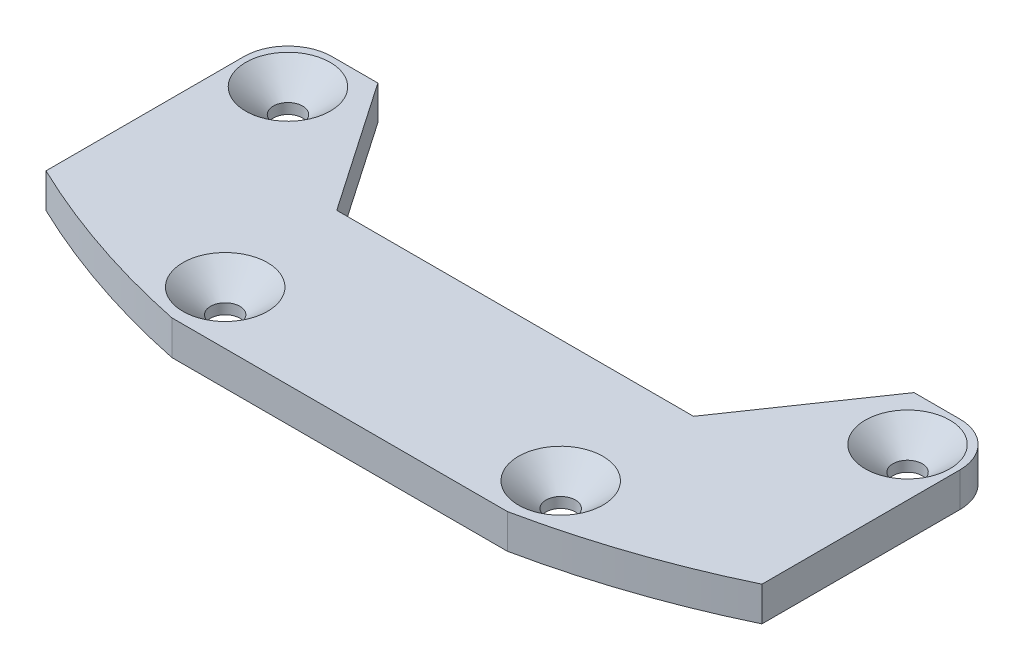
ISO-10303-21;
HEADER;
FILE_DESCRIPTION(('STEP AP214'),'2;1');
FILE_NAME('part.step','',(''),(''),'','','');
FILE_SCHEMA(('AUTOMOTIVE_DESIGN { 1 0 10303 214 1 1 1 1 }'));
ENDSEC;
DATA;
#1=APPLICATION_CONTEXT('core data for automotive mechanical design processes');
#2=APPLICATION_PROTOCOL_DEFINITION('international standard','automotive_design',2000,#1);
#3=PRODUCT_CONTEXT('',#1,'mechanical');
#4=PRODUCT('Part','Part','',(#3));
#5=PRODUCT_RELATED_PRODUCT_CATEGORY('part','',(#4));
#6=PRODUCT_DEFINITION_FORMATION('','',#4);
#7=PRODUCT_DEFINITION_CONTEXT('part definition',#1,'design');
#8=PRODUCT_DEFINITION('design','',#6,#7);
#9=PRODUCT_DEFINITION_SHAPE('','',#8);
#10=(LENGTH_UNIT() NAMED_UNIT(*) SI_UNIT(.MILLI.,.METRE.));
#11=(NAMED_UNIT(*) PLANE_ANGLE_UNIT() SI_UNIT($,.RADIAN.));
#12=(NAMED_UNIT(*) SI_UNIT($,.STERADIAN.) SOLID_ANGLE_UNIT());
#13=UNCERTAINTY_MEASURE_WITH_UNIT(LENGTH_MEASURE(1.E-05),#10,'distance_accuracy_value','');
#14=(GEOMETRIC_REPRESENTATION_CONTEXT(3) GLOBAL_UNCERTAINTY_ASSIGNED_CONTEXT((#13)) GLOBAL_UNIT_ASSIGNED_CONTEXT((#10,
#11,#12)) REPRESENTATION_CONTEXT('',''));
#15=CARTESIAN_POINT('',(0.,0.,0.));
#16=DIRECTION('',(0.,0.,1.));
#17=DIRECTION('',(1.,0.,0.));
#18=AXIS2_PLACEMENT_3D('',#15,#16,#17);
#19=CARTESIAN_POINT('',(28.956,3.175,-10.06475));
#20=DIRECTION('',(0.,-1.,0.));
#21=DIRECTION('',(0.,0.,-1.));
#22=AXIS2_PLACEMENT_3D('',#19,#20,#21);
#23=PLANE('',#22);
#24=CARTESIAN_POINT('',(-28.575,3.175,-9.68374999999997));
#25=DIRECTION('',(0.,-1.,0.));
#26=DIRECTION('',(0.,0.,-1.));
#27=AXIS2_PLACEMENT_3D('',#24,#25,#26);
#28=CIRCLE('',#27,3.8989);
#29=CARTESIAN_POINT('',(-28.575,3.175,-13.58265));
#30=VERTEX_POINT('',#29);
#31=EDGE_CURVE('E216',#30,#30,#28,.T.);
#32=ORIENTED_EDGE('',*,*,#31,.T.);
#33=EDGE_LOOP('',(#32));
#34=FACE_BOUND('',#33,.T.);
#35=CARTESIAN_POINT('',(-15.4730360223843,3.175,9.2075));
#36=DIRECTION('',(0.,-1.,0.));
#37=DIRECTION('',(0.,0.,-1.));
#38=AXIS2_PLACEMENT_3D('',#35,#36,#37);
#39=CIRCLE('',#38,3.8989);
#40=CARTESIAN_POINT('',(-15.4730360223843,3.175,5.3086));
#41=VERTEX_POINT('',#40);
#42=EDGE_CURVE('E213',#41,#41,#39,.T.);
#43=ORIENTED_EDGE('',*,*,#42,.T.);
#44=EDGE_LOOP('',(#43));
#45=FACE_BOUND('',#44,.T.);
#46=CARTESIAN_POINT('',(15.4730360223843,3.175,9.2075));
#47=DIRECTION('',(0.,-1.,0.));
#48=DIRECTION('',(0.,0.,-1.));
#49=AXIS2_PLACEMENT_3D('',#46,#47,#48);
#50=CIRCLE('',#49,3.8989);
#51=CARTESIAN_POINT('',(15.4730360223843,3.175,5.3086));
#52=VERTEX_POINT('',#51);
#53=EDGE_CURVE('E210',#52,#52,#50,.T.);
#54=ORIENTED_EDGE('',*,*,#53,.T.);
#55=EDGE_LOOP('',(#54));
#56=FACE_BOUND('',#55,.T.);
#57=CARTESIAN_POINT('',(28.575,3.175,-9.68374999999997));
#58=DIRECTION('',(0.,-1.,0.));
#59=DIRECTION('',(0.,0.,-1.));
#60=AXIS2_PLACEMENT_3D('',#57,#58,#59);
#61=CIRCLE('',#60,3.8989);
#62=CARTESIAN_POINT('',(28.575,3.175,-13.58265));
#63=VERTEX_POINT('',#62);
#64=EDGE_CURVE('E207',#63,#63,#61,.T.);
#65=ORIENTED_EDGE('',*,*,#64,.T.);
#66=EDGE_LOOP('',(#65));
#67=FACE_BOUND('',#66,.T.);
#68=CARTESIAN_POINT('',(28.956,3.175,-10.06475));
#69=DIRECTION('',(0.,1.,0.));
#70=DIRECTION('',(0.,0.,-1.));
#71=AXIS2_PLACEMENT_3D('',#68,#69,#70);
#72=CIRCLE('',#71,4.064);
#73=CARTESIAN_POINT('',(33.02,3.175,-10.06475));
#74=VERTEX_POINT('',#73);
#75=CARTESIAN_POINT('',(28.956,3.175,-14.12875));
#76=VERTEX_POINT('',#75);
#77=EDGE_CURVE('E177',#74,#76,#72,.T.);
#78=ORIENTED_EDGE('',*,*,#77,.T.);
#79=DIRECTION('',(-1.,0.,0.));
#80=VECTOR('',#79,1.);
#81=CARTESIAN_POINT('',(24.7300560498807,3.175,-14.12875));
#82=LINE('',#81,#80);
#83=CARTESIAN_POINT('',(24.7300560498807,3.175,-14.12875));
#84=VERTEX_POINT('',#83);
#85=EDGE_CURVE('E106',#76,#84,#82,.T.);
#86=ORIENTED_EDGE('',*,*,#85,.T.);
#87=DIRECTION('',(-0.565651383382918,0.,0.824644476412103));
#88=VECTOR('',#87,1.);
#89=CARTESIAN_POINT('',(24.7300560498807,3.175,-14.12875));
#90=LINE('',#89,#88);
#91=CARTESIAN_POINT('',(16.4542667422174,3.175,-2.06375000000011));
#92=VERTEX_POINT('',#91);
#93=EDGE_CURVE('E326',#84,#92,#90,.T.);
#94=ORIENTED_EDGE('',*,*,#93,.T.);
#95=DIRECTION('',(-1.,0.,0.));
#96=VECTOR('',#95,1.);
#97=CARTESIAN_POINT('',(-16.4542667422174,3.175,-2.06375000000011));
#98=LINE('',#97,#96);
#99=CARTESIAN_POINT('',(-16.4542667422174,3.175,-2.06375000000011));
#100=VERTEX_POINT('',#99);
#101=EDGE_CURVE('E328',#92,#100,#98,.T.);
#102=ORIENTED_EDGE('',*,*,#101,.T.);
#103=DIRECTION('',(-0.565651383382593,0.,-0.824644476412326));
#104=VECTOR('',#103,1.);
#105=CARTESIAN_POINT('',(-24.7300560498737,3.175,-14.12875));
#106=LINE('',#105,#104);
#107=CARTESIAN_POINT('',(-24.7300560498737,3.175,-14.12875));
#108=VERTEX_POINT('',#107);
#109=EDGE_CURVE('E330',#100,#108,#106,.T.);
#110=ORIENTED_EDGE('',*,*,#109,.T.);
#111=DIRECTION('',(-1.,0.,0.));
#112=VECTOR('',#111,1.);
#113=CARTESIAN_POINT('',(-28.956,3.175,-14.12875));
#114=LINE('',#113,#112);
#115=CARTESIAN_POINT('',(-28.956,3.175,-14.12875));
#116=VERTEX_POINT('',#115);
#117=EDGE_CURVE('E332',#108,#116,#114,.T.);
#118=ORIENTED_EDGE('',*,*,#117,.T.);
#119=CARTESIAN_POINT('',(-28.956,3.175,-10.06475));
#120=DIRECTION('',(0.,1.,0.));
#121=DIRECTION('',(0.,0.,-1.));
#122=AXIS2_PLACEMENT_3D('',#119,#120,#121);
#123=CIRCLE('',#122,4.064);
#124=CARTESIAN_POINT('',(-33.02,3.175,-10.06475));
#125=VERTEX_POINT('',#124);
#126=EDGE_CURVE('E334',#116,#125,#123,.T.);
#127=ORIENTED_EDGE('',*,*,#126,.T.);
#128=DIRECTION('',(0.,0.,1.));
#129=VECTOR('',#128,1.);
#130=CARTESIAN_POINT('',(-33.02,3.175,8.1902596397465));
#131=LINE('',#130,#129);
#132=CARTESIAN_POINT('',(-33.02,3.175,8.1902596397465));
#133=VERTEX_POINT('',#132);
#134=EDGE_CURVE('E336',#125,#133,#131,.T.);
#135=ORIENTED_EDGE('',*,*,#134,.T.);
#136=CARTESIAN_POINT('',(0.,3.175,-60.48375));
#137=DIRECTION('',(0.,1.,0.));
#138=DIRECTION('',(0.,0.,-1.));
#139=AXIS2_PLACEMENT_3D('',#136,#137,#138);
#140=CIRCLE('',#139,76.2);
#141=CARTESIAN_POINT('',(-15.4730360223841,3.175,14.12875));
#142=VERTEX_POINT('',#141);
#143=EDGE_CURVE('E136',#133,#142,#140,.T.);
#144=ORIENTED_EDGE('',*,*,#143,.T.);
#145=DIRECTION('',(1.,0.,0.));
#146=VECTOR('',#145,1.);
#147=CARTESIAN_POINT('',(-15.4730360223841,3.175,14.12875));
#148=LINE('',#147,#146);
#149=CARTESIAN_POINT('',(15.4730360223841,3.175,14.12875));
#150=VERTEX_POINT('',#149);
#151=EDGE_CURVE('E131',#142,#150,#148,.T.);
#152=ORIENTED_EDGE('',*,*,#151,.T.);
#153=CARTESIAN_POINT('',(0.,3.175,-60.48375));
#154=DIRECTION('',(0.,1.,0.));
#155=DIRECTION('',(0.,0.,-1.));
#156=AXIS2_PLACEMENT_3D('',#153,#154,#155);
#157=CIRCLE('',#156,76.2);
#158=CARTESIAN_POINT('',(33.02,3.175,8.19025963974649));
#159=VERTEX_POINT('',#158);
#160=EDGE_CURVE('E134',#150,#159,#157,.T.);
#161=ORIENTED_EDGE('',*,*,#160,.T.);
#162=DIRECTION('',(0.,0.,-1.));
#163=VECTOR('',#162,1.);
#164=CARTESIAN_POINT('',(33.02,3.175,8.1902596397465));
#165=LINE('',#164,#163);
#166=EDGE_CURVE('E50',#159,#74,#165,.T.);
#167=ORIENTED_EDGE('',*,*,#166,.T.);
#168=EDGE_LOOP('',(#78,#86,#94,#102,#110,#118,#127,#135,#144,#152,#161,#167));
#169=FACE_BOUND('',#168,.T.);
#170=ADVANCED_FACE('F33',(#34,#45,#56,#67,#169),#23,.F.);
#171=CARTESIAN_POINT('',(28.956,0.,-10.06475));
#172=DIRECTION('',(0.,-1.,0.));
#173=DIRECTION('',(0.,0.,-1.));
#174=AXIS2_PLACEMENT_3D('',#171,#172,#173);
#175=PLANE('',#174);
#176=CARTESIAN_POINT('',(15.4730360223843,0.,9.2075));
#177=DIRECTION('',(0.,1.,0.));
#178=DIRECTION('',(0.,0.,-1.));
#179=AXIS2_PLACEMENT_3D('',#176,#177,#178);
#180=CIRCLE('',#179,1.35255);
#181=CARTESIAN_POINT('',(15.4730360223843,0.,7.85495));
#182=VERTEX_POINT('',#181);
#183=EDGE_CURVE('E315',#182,#182,#180,.T.);
#184=ORIENTED_EDGE('',*,*,#183,.T.);
#185=EDGE_LOOP('',(#184));
#186=FACE_BOUND('',#185,.T.);
#187=CARTESIAN_POINT('',(-15.4730360223843,0.,9.2075));
#188=DIRECTION('',(0.,1.,0.));
#189=DIRECTION('',(0.,0.,1.));
#190=AXIS2_PLACEMENT_3D('',#187,#188,#189);
#191=CIRCLE('',#190,1.35255);
#192=CARTESIAN_POINT('',(-15.4730360223843,0.,10.56005));
#193=VERTEX_POINT('',#192);
#194=EDGE_CURVE('E158',#193,#193,#191,.T.);
#195=ORIENTED_EDGE('',*,*,#194,.T.);
#196=EDGE_LOOP('',(#195));
#197=FACE_BOUND('',#196,.T.);
#198=CARTESIAN_POINT('',(28.956,0.,-10.06475));
#199=DIRECTION('',(0.,1.,0.));
#200=DIRECTION('',(0.,0.,-1.));
#201=AXIS2_PLACEMENT_3D('',#198,#199,#200);
#202=CIRCLE('',#201,4.064);
#203=CARTESIAN_POINT('',(33.02,0.,-10.06475));
#204=VERTEX_POINT('',#203);
#205=CARTESIAN_POINT('',(28.956,0.,-14.12875));
#206=VERTEX_POINT('',#205);
#207=EDGE_CURVE('E154',#204,#206,#202,.T.);
#208=ORIENTED_EDGE('',*,*,#207,.F.);
#209=DIRECTION('',(0.,0.,-1.));
#210=VECTOR('',#209,1.);
#211=CARTESIAN_POINT('',(33.02,0.,8.1902596397465));
#212=LINE('',#211,#210);
#213=CARTESIAN_POINT('',(33.02,0.,8.19025963974649));
#214=VERTEX_POINT('',#213);
#215=EDGE_CURVE('E97',#214,#204,#212,.T.);
#216=ORIENTED_EDGE('',*,*,#215,.F.);
#217=CARTESIAN_POINT('',(0.,0.,-60.48375));
#218=DIRECTION('',(0.,1.,0.));
#219=DIRECTION('',(0.,0.,-1.));
#220=AXIS2_PLACEMENT_3D('',#217,#218,#219);
#221=CIRCLE('',#220,76.2);
#222=CARTESIAN_POINT('',(15.4730360223841,0.,14.12875));
#223=VERTEX_POINT('',#222);
#224=EDGE_CURVE('E91',#223,#214,#221,.T.);
#225=ORIENTED_EDGE('',*,*,#224,.F.);
#226=DIRECTION('',(1.,0.,0.));
#227=VECTOR('',#226,1.);
#228=CARTESIAN_POINT('',(-15.4730360223841,0.,14.12875));
#229=LINE('',#228,#227);
#230=CARTESIAN_POINT('',(-15.4730360223841,0.,14.12875));
#231=VERTEX_POINT('',#230);
#232=EDGE_CURVE('E144',#231,#223,#229,.T.);
#233=ORIENTED_EDGE('',*,*,#232,.F.);
#234=CARTESIAN_POINT('',(0.,0.,-60.48375));
#235=DIRECTION('',(0.,1.,0.));
#236=DIRECTION('',(0.,0.,-1.));
#237=AXIS2_PLACEMENT_3D('',#234,#235,#236);
#238=CIRCLE('',#237,76.2);
#239=CARTESIAN_POINT('',(-33.02,0.,8.1902596397465));
#240=VERTEX_POINT('',#239);
#241=EDGE_CURVE('E172',#240,#231,#238,.T.);
#242=ORIENTED_EDGE('',*,*,#241,.F.);
#243=DIRECTION('',(0.,0.,1.));
#244=VECTOR('',#243,1.);
#245=CARTESIAN_POINT('',(-33.02,0.,8.1902596397465));
#246=LINE('',#245,#244);
#247=CARTESIAN_POINT('',(-33.02,0.,-10.06475));
#248=VERTEX_POINT('',#247);
#249=EDGE_CURVE('E170',#248,#240,#246,.T.);
#250=ORIENTED_EDGE('',*,*,#249,.F.);
#251=CARTESIAN_POINT('',(-28.956,0.,-10.06475));
#252=DIRECTION('',(0.,1.,0.));
#253=DIRECTION('',(0.,0.,-1.));
#254=AXIS2_PLACEMENT_3D('',#251,#252,#253);
#255=CIRCLE('',#254,4.064);
#256=CARTESIAN_POINT('',(-28.956,0.,-14.12875));
#257=VERTEX_POINT('',#256);
#258=EDGE_CURVE('E168',#257,#248,#255,.T.);
#259=ORIENTED_EDGE('',*,*,#258,.F.);
#260=DIRECTION('',(-1.,0.,0.));
#261=VECTOR('',#260,1.);
#262=CARTESIAN_POINT('',(-28.956,0.,-14.12875));
#263=LINE('',#262,#261);
#264=CARTESIAN_POINT('',(-24.7300560498737,0.,-14.12875));
#265=VERTEX_POINT('',#264);
#266=EDGE_CURVE('E166',#265,#257,#263,.T.);
#267=ORIENTED_EDGE('',*,*,#266,.F.);
#268=DIRECTION('',(-0.565651383382593,0.,-0.824644476412326));
#269=VECTOR('',#268,1.);
#270=CARTESIAN_POINT('',(-24.7300560498737,0.,-14.12875));
#271=LINE('',#270,#269);
#272=CARTESIAN_POINT('',(-16.4542667422174,0.,-2.06375000000011));
#273=VERTEX_POINT('',#272);
#274=EDGE_CURVE('E164',#273,#265,#271,.T.);
#275=ORIENTED_EDGE('',*,*,#274,.F.);
#276=DIRECTION('',(-1.,0.,0.));
#277=VECTOR('',#276,1.);
#278=CARTESIAN_POINT('',(-16.4542667422174,0.,-2.06375000000011));
#279=LINE('',#278,#277);
#280=CARTESIAN_POINT('',(16.4542667422174,0.,-2.06375000000011));
#281=VERTEX_POINT('',#280);
#282=EDGE_CURVE('E162',#281,#273,#279,.T.);
#283=ORIENTED_EDGE('',*,*,#282,.F.);
#284=DIRECTION('',(-0.565651383382918,0.,0.824644476412103));
#285=VECTOR('',#284,1.);
#286=CARTESIAN_POINT('',(24.7300560498807,0.,-14.12875));
#287=LINE('',#286,#285);
#288=CARTESIAN_POINT('',(24.7300560498807,0.,-14.12875));
#289=VERTEX_POINT('',#288);
#290=EDGE_CURVE('E160',#289,#281,#287,.T.);
#291=ORIENTED_EDGE('',*,*,#290,.F.);
#292=DIRECTION('',(-1.,0.,0.));
#293=VECTOR('',#292,1.);
#294=CARTESIAN_POINT('',(24.7300560498807,0.,-14.12875));
#295=LINE('',#294,#293);
#296=EDGE_CURVE('E157',#206,#289,#295,.T.);
#297=ORIENTED_EDGE('',*,*,#296,.F.);
#298=EDGE_LOOP('',(#208,#216,#225,#233,#242,#250,#259,#267,#275,#283,#291,#297));
#299=FACE_BOUND('',#298,.T.);
#300=CARTESIAN_POINT('',(-28.575,0.,-9.68374999999997));
#301=DIRECTION('',(0.,1.,0.));
#302=DIRECTION('',(0.,0.,1.));
#303=AXIS2_PLACEMENT_3D('',#300,#301,#302);
#304=CIRCLE('',#303,1.35255);
#305=CARTESIAN_POINT('',(-28.575,0.,-8.33119999999997));
#306=VERTEX_POINT('',#305);
#307=EDGE_CURVE('E313',#306,#306,#304,.T.);
#308=ORIENTED_EDGE('',*,*,#307,.T.);
#309=EDGE_LOOP('',(#308));
#310=FACE_BOUND('',#309,.T.);
#311=CARTESIAN_POINT('',(28.575,0.,-9.68374999999997));
#312=DIRECTION('',(0.,1.,0.));
#313=DIRECTION('',(0.,0.,-1.));
#314=AXIS2_PLACEMENT_3D('',#311,#312,#313);
#315=CIRCLE('',#314,1.35255);
#316=CARTESIAN_POINT('',(28.575,0.,-11.0363));
#317=VERTEX_POINT('',#316);
#318=EDGE_CURVE('E320',#317,#317,#315,.T.);
#319=ORIENTED_EDGE('',*,*,#318,.T.);
#320=EDGE_LOOP('',(#319));
#321=FACE_BOUND('',#320,.T.);
#322=ADVANCED_FACE('F241',(#186,#197,#299,#310,#321),#175,.T.);
#323=CARTESIAN_POINT('',(28.956,3.175,-10.06475));
#324=DIRECTION('',(0.,-1.,0.));
#325=DIRECTION('',(0.,0.,-1.));
#326=AXIS2_PLACEMENT_3D('',#323,#324,#325);
#327=CYLINDRICAL_SURFACE('',#326,4.064);
#328=ORIENTED_EDGE('',*,*,#207,.T.);
#329=DIRECTION('',(0.,-1.,0.));
#330=VECTOR('',#329,1.);
#331=CARTESIAN_POINT('',(28.956,3.175,-14.12875));
#332=LINE('',#331,#330);
#333=EDGE_CURVE('E202',#76,#206,#332,.T.);
#334=ORIENTED_EDGE('',*,*,#333,.F.);
#335=ORIENTED_EDGE('',*,*,#77,.F.);
#336=DIRECTION('',(0.,-1.,0.));
#337=VECTOR('',#336,1.);
#338=CARTESIAN_POINT('',(33.02,3.175,-10.06475));
#339=LINE('',#338,#337);
#340=EDGE_CURVE('E150',#74,#204,#339,.T.);
#341=ORIENTED_EDGE('',*,*,#340,.T.);
#342=EDGE_LOOP('',(#328,#334,#335,#341));
#343=FACE_BOUND('',#342,.T.);
#344=ADVANCED_FACE('F247',(#343),#327,.T.);
#345=CARTESIAN_POINT('',(24.7300560498807,3.175,-14.12875));
#346=DIRECTION('',(0.,0.,1.));
#347=DIRECTION('',(1.,0.,0.));
#348=AXIS2_PLACEMENT_3D('',#345,#346,#347);
#349=PLANE('',#348);
#350=ORIENTED_EDGE('',*,*,#296,.T.);
#351=DIRECTION('',(0.,-1.,0.));
#352=VECTOR('',#351,1.);
#353=CARTESIAN_POINT('',(24.7300560498807,3.175,-14.12875));
#354=LINE('',#353,#352);
#355=EDGE_CURVE('E199',#84,#289,#354,.T.);
#356=ORIENTED_EDGE('',*,*,#355,.F.);
#357=ORIENTED_EDGE('',*,*,#85,.F.);
#358=ORIENTED_EDGE('',*,*,#333,.T.);
#359=EDGE_LOOP('',(#350,#356,#357,#358));
#360=FACE_BOUND('',#359,.T.);
#361=ADVANCED_FACE('F289',(#360),#349,.F.);
#362=CARTESIAN_POINT('',(24.7300560498807,3.175,-14.12875));
#363=DIRECTION('',(0.824644476412102,0.,0.565651383382918));
#364=DIRECTION('',(0.565651383382918,0.,-0.824644476412103));
#365=AXIS2_PLACEMENT_3D('',#362,#363,#364);
#366=PLANE('',#365);
#367=ORIENTED_EDGE('',*,*,#290,.T.);
#368=DIRECTION('',(0.,-1.,0.));
#369=VECTOR('',#368,1.);
#370=CARTESIAN_POINT('',(16.4542667422174,3.175,-2.06375000000011));
#371=LINE('',#370,#369);
#372=EDGE_CURVE('E196',#92,#281,#371,.T.);
#373=ORIENTED_EDGE('',*,*,#372,.F.);
#374=ORIENTED_EDGE('',*,*,#93,.F.);
#375=ORIENTED_EDGE('',*,*,#355,.T.);
#376=EDGE_LOOP('',(#367,#373,#374,#375));
#377=FACE_BOUND('',#376,.T.);
#378=ADVANCED_FACE('F285',(#377),#366,.F.);
#379=CARTESIAN_POINT('',(-16.4542667422174,3.175,-2.06375000000011));
#380=DIRECTION('',(0.,0.,1.));
#381=DIRECTION('',(1.,0.,0.));
#382=AXIS2_PLACEMENT_3D('',#379,#380,#381);
#383=PLANE('',#382);
#384=ORIENTED_EDGE('',*,*,#282,.T.);
#385=DIRECTION('',(0.,-1.,0.));
#386=VECTOR('',#385,1.);
#387=CARTESIAN_POINT('',(-16.4542667422174,3.175,-2.06375000000011));
#388=LINE('',#387,#386);
#389=EDGE_CURVE('E193',#100,#273,#388,.T.);
#390=ORIENTED_EDGE('',*,*,#389,.F.);
#391=ORIENTED_EDGE('',*,*,#101,.F.);
#392=ORIENTED_EDGE('',*,*,#372,.T.);
#393=EDGE_LOOP('',(#384,#390,#391,#392));
#394=FACE_BOUND('',#393,.T.);
#395=ADVANCED_FACE('F281',(#394),#383,.F.);
#396=CARTESIAN_POINT('',(-24.7300560498737,3.175,-14.12875));
#397=DIRECTION('',(-0.824644476412325,0.,0.565651383382593));
#398=DIRECTION('',(0.565651383382593,0.,0.824644476412326));
#399=AXIS2_PLACEMENT_3D('',#396,#397,#398);
#400=PLANE('',#399);
#401=ORIENTED_EDGE('',*,*,#274,.T.);
#402=DIRECTION('',(0.,-1.,0.));
#403=VECTOR('',#402,1.);
#404=CARTESIAN_POINT('',(-24.7300560498737,3.175,-14.12875));
#405=LINE('',#404,#403);
#406=EDGE_CURVE('E190',#108,#265,#405,.T.);
#407=ORIENTED_EDGE('',*,*,#406,.F.);
#408=ORIENTED_EDGE('',*,*,#109,.F.);
#409=ORIENTED_EDGE('',*,*,#389,.T.);
#410=EDGE_LOOP('',(#401,#407,#408,#409));
#411=FACE_BOUND('',#410,.T.);
#412=ADVANCED_FACE('F277',(#411),#400,.F.);
#413=CARTESIAN_POINT('',(-28.956,3.175,-14.12875));
#414=DIRECTION('',(0.,0.,1.));
#415=DIRECTION('',(1.,0.,0.));
#416=AXIS2_PLACEMENT_3D('',#413,#414,#415);
#417=PLANE('',#416);
#418=ORIENTED_EDGE('',*,*,#266,.T.);
#419=DIRECTION('',(0.,-1.,0.));
#420=VECTOR('',#419,1.);
#421=CARTESIAN_POINT('',(-28.956,3.175,-14.12875));
#422=LINE('',#421,#420);
#423=EDGE_CURVE('E187',#116,#257,#422,.T.);
#424=ORIENTED_EDGE('',*,*,#423,.F.);
#425=ORIENTED_EDGE('',*,*,#117,.F.);
#426=ORIENTED_EDGE('',*,*,#406,.T.);
#427=EDGE_LOOP('',(#418,#424,#425,#426));
#428=FACE_BOUND('',#427,.T.);
#429=ADVANCED_FACE('F273',(#428),#417,.F.);
#430=CARTESIAN_POINT('',(-28.956,3.175,-10.06475));
#431=DIRECTION('',(0.,-1.,0.));
#432=DIRECTION('',(0.,0.,-1.));
#433=AXIS2_PLACEMENT_3D('',#430,#431,#432);
#434=CYLINDRICAL_SURFACE('',#433,4.064);
#435=ORIENTED_EDGE('',*,*,#258,.T.);
#436=DIRECTION('',(0.,-1.,0.));
#437=VECTOR('',#436,1.);
#438=CARTESIAN_POINT('',(-33.02,3.175,-10.06475));
#439=LINE('',#438,#437);
#440=EDGE_CURVE('E184',#125,#248,#439,.T.);
#441=ORIENTED_EDGE('',*,*,#440,.F.);
#442=ORIENTED_EDGE('',*,*,#126,.F.);
#443=ORIENTED_EDGE('',*,*,#423,.T.);
#444=EDGE_LOOP('',(#435,#441,#442,#443));
#445=FACE_BOUND('',#444,.T.);
#446=ADVANCED_FACE('F269',(#445),#434,.T.);
#447=CARTESIAN_POINT('',(-33.02,3.175,8.1902596397465));
#448=DIRECTION('',(1.,0.,0.));
#449=DIRECTION('',(0.,0.,-1.));
#450=AXIS2_PLACEMENT_3D('',#447,#448,#449);
#451=PLANE('',#450);
#452=ORIENTED_EDGE('',*,*,#249,.T.);
#453=DIRECTION('',(0.,-1.,0.));
#454=VECTOR('',#453,1.);
#455=CARTESIAN_POINT('',(-33.02,3.175,8.1902596397465));
#456=LINE('',#455,#454);
#457=EDGE_CURVE('E181',#133,#240,#456,.T.);
#458=ORIENTED_EDGE('',*,*,#457,.F.);
#459=ORIENTED_EDGE('',*,*,#134,.F.);
#460=ORIENTED_EDGE('',*,*,#440,.T.);
#461=EDGE_LOOP('',(#452,#458,#459,#460));
#462=FACE_BOUND('',#461,.T.);
#463=ADVANCED_FACE('F265',(#462),#451,.F.);
#464=CARTESIAN_POINT('',(0.,3.175,-60.48375));
#465=DIRECTION('',(0.,-1.,0.));
#466=DIRECTION('',(0.,0.,-1.));
#467=AXIS2_PLACEMENT_3D('',#464,#465,#466);
#468=CYLINDRICAL_SURFACE('',#467,76.2);
#469=ORIENTED_EDGE('',*,*,#241,.T.);
#470=DIRECTION('',(0.,-1.,0.));
#471=VECTOR('',#470,1.);
#472=CARTESIAN_POINT('',(-15.4730360223841,3.175,14.12875));
#473=LINE('',#472,#471);
#474=EDGE_CURVE('E145',#142,#231,#473,.T.);
#475=ORIENTED_EDGE('',*,*,#474,.F.);
#476=ORIENTED_EDGE('',*,*,#143,.F.);
#477=ORIENTED_EDGE('',*,*,#457,.T.);
#478=EDGE_LOOP('',(#469,#475,#476,#477));
#479=FACE_BOUND('',#478,.T.);
#480=ADVANCED_FACE('F262',(#479),#468,.T.);
#481=CARTESIAN_POINT('',(-15.4730360223841,3.175,14.12875));
#482=DIRECTION('',(0.,0.,-1.));
#483=DIRECTION('',(-1.,0.,0.));
#484=AXIS2_PLACEMENT_3D('',#481,#482,#483);
#485=PLANE('',#484);
#486=ORIENTED_EDGE('',*,*,#232,.T.);
#487=DIRECTION('',(0.,-1.,0.));
#488=VECTOR('',#487,1.);
#489=CARTESIAN_POINT('',(15.4730360223841,3.175,14.12875));
#490=LINE('',#489,#488);
#491=EDGE_CURVE('E141',#150,#223,#490,.T.);
#492=ORIENTED_EDGE('',*,*,#491,.F.);
#493=ORIENTED_EDGE('',*,*,#151,.F.);
#494=ORIENTED_EDGE('',*,*,#474,.T.);
#495=EDGE_LOOP('',(#486,#492,#493,#494));
#496=FACE_BOUND('',#495,.T.);
#497=ADVANCED_FACE('F142',(#496),#485,.F.);
#498=CARTESIAN_POINT('',(0.,3.175,-60.48375));
#499=DIRECTION('',(0.,-1.,0.));
#500=DIRECTION('',(0.,0.,-1.));
#501=AXIS2_PLACEMENT_3D('',#498,#499,#500);
#502=CYLINDRICAL_SURFACE('',#501,76.2);
#503=ORIENTED_EDGE('',*,*,#224,.T.);
#504=DIRECTION('',(0.,-1.,0.));
#505=VECTOR('',#504,1.);
#506=CARTESIAN_POINT('',(33.02,3.175,8.19025963974649));
#507=LINE('',#506,#505);
#508=EDGE_CURVE('E146',#159,#214,#507,.T.);
#509=ORIENTED_EDGE('',*,*,#508,.F.);
#510=ORIENTED_EDGE('',*,*,#160,.F.);
#511=ORIENTED_EDGE('',*,*,#491,.T.);
#512=EDGE_LOOP('',(#503,#509,#510,#511));
#513=FACE_BOUND('',#512,.T.);
#514=ADVANCED_FACE('F148',(#513),#502,.T.);
#515=CARTESIAN_POINT('',(33.02,3.175,8.1902596397465));
#516=DIRECTION('',(-1.,0.,0.));
#517=DIRECTION('',(0.,0.,1.));
#518=AXIS2_PLACEMENT_3D('',#515,#516,#517);
#519=PLANE('',#518);
#520=ORIENTED_EDGE('',*,*,#215,.T.);
#521=ORIENTED_EDGE('',*,*,#340,.F.);
#522=ORIENTED_EDGE('',*,*,#166,.F.);
#523=ORIENTED_EDGE('',*,*,#508,.T.);
#524=EDGE_LOOP('',(#520,#521,#522,#523));
#525=FACE_BOUND('',#524,.T.);
#526=ADVANCED_FACE('F255',(#525),#519,.F.);
#527=CARTESIAN_POINT('',(-15.4730360223843,3.175,9.2075));
#528=DIRECTION('',(0.,-1.,0.));
#529=DIRECTION('',(0.,0.,-1.));
#530=AXIS2_PLACEMENT_3D('',#527,#528,#529);
#531=CYLINDRICAL_SURFACE('',#530,1.35255);
#532=CARTESIAN_POINT('',(-15.4730360223843,0.961491715161668,9.2075));
#533=DIRECTION('',(0.,-1.,0.));
#534=DIRECTION('',(0.,0.,-1.));
#535=AXIS2_PLACEMENT_3D('',#532,#533,#534);
#536=CIRCLE('',#535,1.35255);
#537=CARTESIAN_POINT('',(-15.4730360223843,0.961491715161668,7.85495));
#538=VERTEX_POINT('',#537);
#539=EDGE_CURVE('E219',#538,#538,#536,.F.);
#540=ORIENTED_EDGE('',*,*,#539,.T.);
#541=EDGE_LOOP('',(#540));
#542=FACE_BOUND('',#541,.T.);
#543=ORIENTED_EDGE('',*,*,#194,.F.);
#544=EDGE_LOOP('',(#543));
#545=FACE_BOUND('',#544,.T.);
#546=ADVANCED_FACE('F252',(#542,#545),#531,.F.);
#547=CARTESIAN_POINT('',(-28.575,3.175,-9.68374999999997));
#548=DIRECTION('',(0.,-1.,0.));
#549=DIRECTION('',(0.,0.,-1.));
#550=AXIS2_PLACEMENT_3D('',#547,#548,#549);
#551=CYLINDRICAL_SURFACE('',#550,1.35255);
#552=CARTESIAN_POINT('',(-28.575,0.961491715161655,-9.68374999999997));
#553=DIRECTION('',(0.,-1.,0.));
#554=DIRECTION('',(0.,0.,-1.));
#555=AXIS2_PLACEMENT_3D('',#552,#553,#554);
#556=CIRCLE('',#555,1.35255);
#557=CARTESIAN_POINT('',(-28.575,0.961491715161655,-11.0363));
#558=VERTEX_POINT('',#557);
#559=EDGE_CURVE('E204',#558,#558,#556,.F.);
#560=ORIENTED_EDGE('',*,*,#559,.T.);
#561=EDGE_LOOP('',(#560));
#562=FACE_BOUND('',#561,.T.);
#563=ORIENTED_EDGE('',*,*,#307,.F.);
#564=EDGE_LOOP('',(#563));
#565=FACE_BOUND('',#564,.T.);
#566=ADVANCED_FACE('F308',(#562,#565),#551,.F.);
#567=CARTESIAN_POINT('',(15.4730360223843,3.175,9.2075));
#568=DIRECTION('',(0.,-1.,0.));
#569=DIRECTION('',(0.,0.,-1.));
#570=AXIS2_PLACEMENT_3D('',#567,#568,#569);
#571=CYLINDRICAL_SURFACE('',#570,1.35255);
#572=CARTESIAN_POINT('',(15.4730360223843,0.961491715161657,9.2075));
#573=DIRECTION('',(0.,-1.,0.));
#574=DIRECTION('',(0.,0.,-1.));
#575=AXIS2_PLACEMENT_3D('',#572,#573,#574);
#576=CIRCLE('',#575,1.35255);
#577=CARTESIAN_POINT('',(15.4730360223843,0.961491715161657,7.85495));
#578=VERTEX_POINT('',#577);
#579=EDGE_CURVE('E42',#578,#578,#576,.F.);
#580=ORIENTED_EDGE('',*,*,#579,.T.);
#581=EDGE_LOOP('',(#580));
#582=FACE_BOUND('',#581,.T.);
#583=ORIENTED_EDGE('',*,*,#183,.F.);
#584=EDGE_LOOP('',(#583));
#585=FACE_BOUND('',#584,.T.);
#586=ADVANCED_FACE('F224',(#582,#585),#571,.F.);
#587=CARTESIAN_POINT('',(28.575,3.175,-9.68374999999997));
#588=DIRECTION('',(0.,-1.,0.));
#589=DIRECTION('',(0.,0.,-1.));
#590=AXIS2_PLACEMENT_3D('',#587,#588,#589);
#591=CYLINDRICAL_SURFACE('',#590,1.35255);
#592=CARTESIAN_POINT('',(28.575,0.961491715161655,-9.68374999999997));
#593=DIRECTION('',(0.,-1.,0.));
#594=DIRECTION('',(0.,0.,-1.));
#595=AXIS2_PLACEMENT_3D('',#592,#593,#594);
#596=CIRCLE('',#595,1.35255);
#597=CARTESIAN_POINT('',(28.575,0.961491715161655,-11.0363));
#598=VERTEX_POINT('',#597);
#599=EDGE_CURVE('E11',#598,#598,#596,.F.);
#600=ORIENTED_EDGE('',*,*,#599,.T.);
#601=EDGE_LOOP('',(#600));
#602=FACE_BOUND('',#601,.T.);
#603=ORIENTED_EDGE('',*,*,#318,.F.);
#604=EDGE_LOOP('',(#603));
#605=FACE_BOUND('',#604,.T.);
#606=ADVANCED_FACE('F297',(#602,#605),#591,.F.);
#607=CARTESIAN_POINT('',(-28.575,0.961491715161655,-9.68374999999997));
#608=DIRECTION('',(0.,1.,0.));
#609=DIRECTION('',(0.,0.,1.));
#610=AXIS2_PLACEMENT_3D('',#607,#608,#609);
#611=CONICAL_SURFACE('',#610,1.35255,0.855211333477223);
#612=ORIENTED_EDGE('',*,*,#31,.F.);
#613=EDGE_LOOP('',(#612));
#614=FACE_BOUND('',#613,.T.);
#615=ORIENTED_EDGE('',*,*,#559,.F.);
#616=EDGE_LOOP('',(#615));
#617=FACE_BOUND('',#616,.T.);
#618=ADVANCED_FACE('F236',(#614,#617),#611,.F.);
#619=CARTESIAN_POINT('',(-15.4730360223843,0.961491715161668,9.2075));
#620=DIRECTION('',(0.,1.,0.));
#621=DIRECTION('',(0.,0.,1.));
#622=AXIS2_PLACEMENT_3D('',#619,#620,#621);
#623=CONICAL_SURFACE('',#622,1.35255,0.855211333477225);
#624=ORIENTED_EDGE('',*,*,#42,.F.);
#625=EDGE_LOOP('',(#624));
#626=FACE_BOUND('',#625,.T.);
#627=ORIENTED_EDGE('',*,*,#539,.F.);
#628=EDGE_LOOP('',(#627));
#629=FACE_BOUND('',#628,.T.);
#630=ADVANCED_FACE('F229',(#626,#629),#623,.F.);
#631=CARTESIAN_POINT('',(15.4730360223843,0.961491715161657,9.2075));
#632=DIRECTION('',(0.,1.,0.));
#633=DIRECTION('',(0.,0.,1.));
#634=AXIS2_PLACEMENT_3D('',#631,#632,#633);
#635=CONICAL_SURFACE('',#634,1.35255,0.855211333477223);
#636=ORIENTED_EDGE('',*,*,#53,.F.);
#637=EDGE_LOOP('',(#636));
#638=FACE_BOUND('',#637,.T.);
#639=ORIENTED_EDGE('',*,*,#579,.F.);
#640=EDGE_LOOP('',(#639));
#641=FACE_BOUND('',#640,.T.);
#642=ADVANCED_FACE('F227',(#638,#641),#635,.F.);
#643=CARTESIAN_POINT('',(28.575,0.961491715161655,-9.68374999999997));
#644=DIRECTION('',(0.,1.,0.));
#645=DIRECTION('',(0.,0.,1.));
#646=AXIS2_PLACEMENT_3D('',#643,#644,#645);
#647=CONICAL_SURFACE('',#646,1.35255,0.855211333477223);
#648=ORIENTED_EDGE('',*,*,#64,.F.);
#649=EDGE_LOOP('',(#648));
#650=FACE_BOUND('',#649,.T.);
#651=ORIENTED_EDGE('',*,*,#599,.F.);
#652=EDGE_LOOP('',(#651));
#653=FACE_BOUND('',#652,.T.);
#654=ADVANCED_FACE('F35',(#650,#653),#647,.F.);
#655=CLOSED_SHELL('',(#170,#322,#344,#361,#378,#395,#412,#429,#446,#463,#480,#497,#514,#526,
#546,#566,#586,#606,#618,#630,#642,#654));
#656=MANIFOLD_SOLID_BREP('B2',#655);
#657=ADVANCED_BREP_SHAPE_REPRESENTATION('',(#18,#656),#14);
#658=SHAPE_DEFINITION_REPRESENTATION(#9,#657);
ENDSEC;
END-ISO-10303-21;
